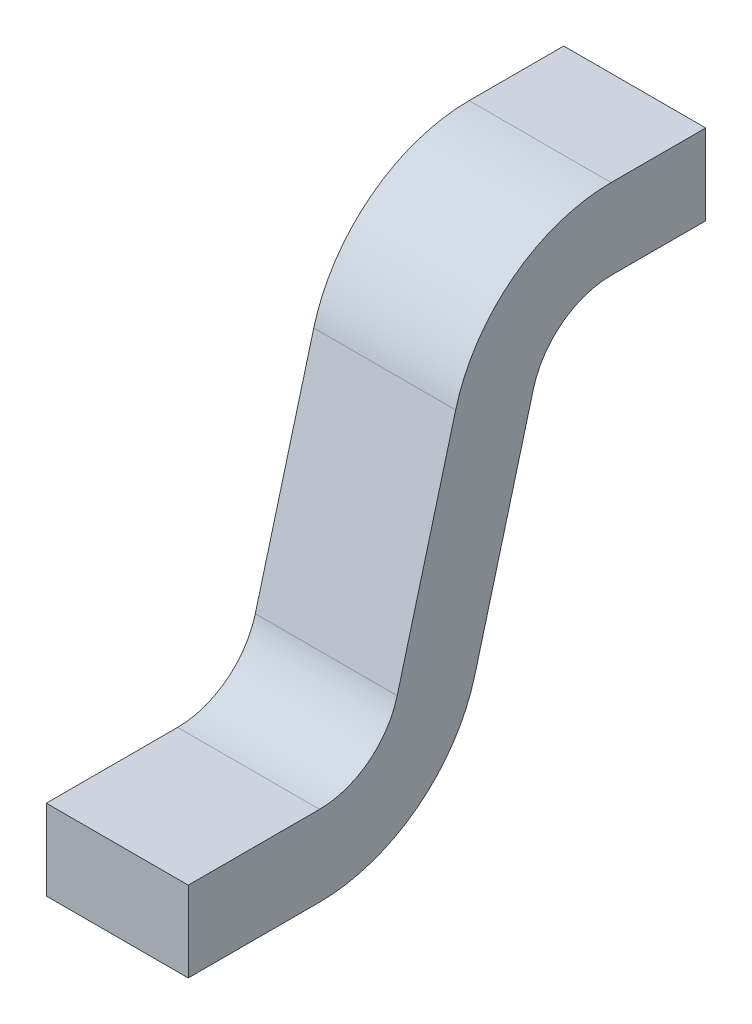
ISO-10303-21;
HEADER;
FILE_DESCRIPTION(('STEP AP214'),'2;1');
FILE_NAME('part.step','',(''),(''),'','','');
FILE_SCHEMA(('AUTOMOTIVE_DESIGN { 1 0 10303 214 1 1 1 1 }'));
ENDSEC;
DATA;
#1=APPLICATION_CONTEXT('core data for automotive mechanical design processes');
#2=APPLICATION_PROTOCOL_DEFINITION('international standard','automotive_design',2000,#1);
#3=PRODUCT_CONTEXT('',#1,'mechanical');
#4=PRODUCT('Part','Part','',(#3));
#5=PRODUCT_RELATED_PRODUCT_CATEGORY('part','',(#4));
#6=PRODUCT_DEFINITION_FORMATION('','',#4);
#7=PRODUCT_DEFINITION_CONTEXT('part definition',#1,'design');
#8=PRODUCT_DEFINITION('design','',#6,#7);
#9=PRODUCT_DEFINITION_SHAPE('','',#8);
#10=(LENGTH_UNIT() NAMED_UNIT(*) SI_UNIT(.MILLI.,.METRE.));
#11=(NAMED_UNIT(*) PLANE_ANGLE_UNIT() SI_UNIT($,.RADIAN.));
#12=(NAMED_UNIT(*) SI_UNIT($,.STERADIAN.) SOLID_ANGLE_UNIT());
#13=UNCERTAINTY_MEASURE_WITH_UNIT(LENGTH_MEASURE(1.E-05),#10,'distance_accuracy_value','');
#14=(GEOMETRIC_REPRESENTATION_CONTEXT(3) GLOBAL_UNCERTAINTY_ASSIGNED_CONTEXT((#13)) GLOBAL_UNIT_ASSIGNED_CONTEXT((#10,
#11,#12)) REPRESENTATION_CONTEXT('',''));
#15=CARTESIAN_POINT('',(0.,0.,0.));
#16=DIRECTION('',(0.,0.,1.));
#17=DIRECTION('',(1.,0.,0.));
#18=AXIS2_PLACEMENT_3D('',#15,#16,#17);
#19=CARTESIAN_POINT('',(-0.15,-0.839203393915477,-0.306328844074898));
#20=DIRECTION('',(-1.,0.,0.));
#21=DIRECTION('',(0.,0.,1.));
#22=AXIS2_PLACEMENT_3D('',#19,#20,#21);
#23=PLANE('',#22);
#24=DIRECTION('',(0.,0.,-1.));
#25=VECTOR('',#24,1.);
#26=CARTESIAN_POINT('',(-0.15,0.,0.7));
#27=LINE('',#26,#25);
#28=CARTESIAN_POINT('',(-0.15,0.,0.2));
#29=VERTEX_POINT('',#28);
#30=CARTESIAN_POINT('',(-0.15,0.,0.));
#31=VERTEX_POINT('',#30);
#32=EDGE_CURVE('E129',#29,#31,#27,.T.);
#33=ORIENTED_EDGE('',*,*,#32,.F.);
#34=CARTESIAN_POINT('',(-0.15,-0.17,0.2));
#35=DIRECTION('',(1.,0.,0.));
#36=DIRECTION('',(0.,0.,-1.));
#37=AXIS2_PLACEMENT_3D('',#34,#35,#36);
#38=CIRCLE('',#37,0.17);
#39=CARTESIAN_POINT('',(-0.15,-0.126000762332572,0.364207390469142));
#40=VERTEX_POINT('',#39);
#41=EDGE_CURVE('E138',#29,#40,#38,.T.);
#42=ORIENTED_EDGE('',*,*,#41,.T.);
#43=DIRECTION('',(0.,0.965925826289068,-0.258819045102521));
#44=VECTOR('',#43,1.);
#45=CARTESIAN_POINT('',(-0.15,-0.39401670399252,0.436022045595592));
#46=LINE('',#45,#44);
#47=CARTESIAN_POINT('',(-0.15,-0.587201869250333,0.487785854616096));
#48=VERTEX_POINT('',#47);
#49=EDGE_CURVE('E135',#48,#40,#46,.T.);
#50=ORIENTED_EDGE('',*,*,#49,.F.);
#51=CARTESIAN_POINT('',(-0.15,-0.499203393915476,0.816200635554379));
#52=DIRECTION('',(-1.,0.,0.));
#53=DIRECTION('',(0.,-1.,0.));
#54=AXIS2_PLACEMENT_3D('',#51,#52,#53);
#55=CIRCLE('',#54,0.34);
#56=CARTESIAN_POINT('',(-0.15,-0.839203393915477,0.816200635554379));
#57=VERTEX_POINT('',#56);
#58=EDGE_CURVE('E170',#57,#48,#55,.F.);
#59=ORIENTED_EDGE('',*,*,#58,.F.);
#60=DIRECTION('',(0.,0.,-1.));
#61=VECTOR('',#60,1.);
#62=CARTESIAN_POINT('',(-0.149999999999999,-0.839203393915477,0.393671155925102));
#63=LINE('',#62,#61);
#64=CARTESIAN_POINT('',(-0.149999999999999,-0.839203393915476,1.0936711559251));
#65=VERTEX_POINT('',#64);
#66=EDGE_CURVE('E140',#65,#57,#63,.T.);
#67=ORIENTED_EDGE('',*,*,#66,.F.);
#68=DIRECTION('',(0.,-1.,0.));
#69=VECTOR('',#68,1.);
#70=CARTESIAN_POINT('',(-0.149999999999999,-0.839203393915476,1.0936711559251));
#71=LINE('',#70,#69);
#72=CARTESIAN_POINT('',(-0.149999999999999,-0.669203393915476,1.0936711559251));
#73=VERTEX_POINT('',#72);
#74=EDGE_CURVE('E146',#73,#65,#71,.T.);
#75=ORIENTED_EDGE('',*,*,#74,.F.);
#76=DIRECTION('',(0.,0.,1.));
#77=VECTOR('',#76,1.);
#78=CARTESIAN_POINT('',(-0.149999999999999,-0.669203393915477,0.393671155925102));
#79=LINE('',#78,#77);
#80=CARTESIAN_POINT('',(-0.149999999999999,-0.669203393915477,0.816200635554379));
#81=VERTEX_POINT('',#80);
#82=EDGE_CURVE('E99',#81,#73,#79,.T.);
#83=ORIENTED_EDGE('',*,*,#82,.F.);
#84=CARTESIAN_POINT('',(-0.149999999999999,-0.499203393915476,0.816200635554379));
#85=DIRECTION('',(-1.,0.,0.));
#86=DIRECTION('',(0.,-1.,0.));
#87=AXIS2_PLACEMENT_3D('',#84,#85,#86);
#88=CIRCLE('',#87,0.17);
#89=CARTESIAN_POINT('',(-0.149999999999999,-0.543202631582905,0.651993245085237));
#90=VERTEX_POINT('',#89);
#91=EDGE_CURVE('E19',#81,#90,#88,.F.);
#92=ORIENTED_EDGE('',*,*,#91,.T.);
#93=DIRECTION('',(0.,-0.965925826289068,0.258819045102521));
#94=VECTOR('',#93,1.);
#95=CARTESIAN_POINT('',(-0.15,-0.350017466325091,0.600229436064733));
#96=LINE('',#95,#94);
#97=CARTESIAN_POINT('',(-0.15,-0.0820015246651429,0.528414780938283));
#98=VERTEX_POINT('',#97);
#99=EDGE_CURVE('E96',#98,#90,#96,.T.);
#100=ORIENTED_EDGE('',*,*,#99,.F.);
#101=CARTESIAN_POINT('',(-0.15,-0.17,0.2));
#102=DIRECTION('',(1.,0.,0.));
#103=DIRECTION('',(0.,0.,-1.));
#104=AXIS2_PLACEMENT_3D('',#101,#102,#103);
#105=CIRCLE('',#104,0.34);
#106=CARTESIAN_POINT('',(-0.15,0.17,0.2));
#107=VERTEX_POINT('',#106);
#108=EDGE_CURVE('E167',#107,#98,#105,.T.);
#109=ORIENTED_EDGE('',*,*,#108,.F.);
#110=DIRECTION('',(0.,0.,1.));
#111=VECTOR('',#110,1.);
#112=CARTESIAN_POINT('',(-0.15,0.17,0.7));
#113=LINE('',#112,#111);
#114=CARTESIAN_POINT('',(-0.15,0.17,0.));
#115=VERTEX_POINT('',#114);
#116=EDGE_CURVE('E118',#115,#107,#113,.T.);
#117=ORIENTED_EDGE('',*,*,#116,.F.);
#118=DIRECTION('',(0.,1.,0.));
#119=VECTOR('',#118,1.);
#120=CARTESIAN_POINT('',(-0.15,0.,0.));
#121=LINE('',#120,#119);
#122=EDGE_CURVE('E123',#31,#115,#121,.T.);
#123=ORIENTED_EDGE('',*,*,#122,.F.);
#124=EDGE_LOOP('',(#33,#42,#50,#59,#67,#75,#83,#92,#100,#109,#117,#123));
#125=FACE_BOUND('',#124,.T.);
#126=ADVANCED_FACE('F16',(#125),#23,.T.);
#127=CARTESIAN_POINT('',(0.,-0.350017466325091,0.600229436064733));
#128=DIRECTION('',(0.,0.258819045102521,0.965925826289068));
#129=DIRECTION('',(0.,-0.965925826289068,0.258819045102521));
#130=AXIS2_PLACEMENT_3D('',#127,#128,#129);
#131=PLANE('',#130);
#132=DIRECTION('',(-1.,0.,0.));
#133=VECTOR('',#132,1.);
#134=CARTESIAN_POINT('',(-0.267707469156736,-0.543202631582905,0.651993245085238));
#135=LINE('',#134,#133);
#136=CARTESIAN_POINT('',(0.15,-0.543202631582905,0.651993245085238));
#137=VERTEX_POINT('',#136);
#138=EDGE_CURVE('E101',#90,#137,#135,.F.);
#139=ORIENTED_EDGE('',*,*,#138,.T.);
#140=DIRECTION('',(0.,-0.965925826289068,0.258819045102522));
#141=VECTOR('',#140,1.);
#142=CARTESIAN_POINT('',(0.15,-0.0820015246651429,0.528414780938283));
#143=LINE('',#142,#141);
#144=CARTESIAN_POINT('',(0.15,-0.0820015246651427,0.528414780938283));
#145=VERTEX_POINT('',#144);
#146=EDGE_CURVE('E166',#145,#137,#143,.T.);
#147=ORIENTED_EDGE('',*,*,#146,.F.);
#148=DIRECTION('',(1.,0.,0.));
#149=VECTOR('',#148,1.);
#150=CARTESIAN_POINT('',(0.194661618624334,-0.0820015246651429,0.528414780938283));
#151=LINE('',#150,#149);
#152=EDGE_CURVE('E106',#98,#145,#151,.T.);
#153=ORIENTED_EDGE('',*,*,#152,.F.);
#154=ORIENTED_EDGE('',*,*,#99,.T.);
#155=EDGE_LOOP('',(#139,#147,#153,#154));
#156=FACE_BOUND('',#155,.T.);
#157=ADVANCED_FACE('F103',(#156),#131,.T.);
#158=CARTESIAN_POINT('',(-0.267707469156736,-0.499203393915476,0.816200635554379));
#159=DIRECTION('',(-1.,0.,0.));
#160=DIRECTION('',(0.,-1.,0.));
#161=AXIS2_PLACEMENT_3D('',#158,#159,#160);
#162=CYLINDRICAL_SURFACE('',#161,0.17);
#163=CARTESIAN_POINT('',(0.15,-0.499203393915476,0.816200635554379));
#164=DIRECTION('',(-1.,0.,0.));
#165=DIRECTION('',(0.,-1.,0.));
#166=AXIS2_PLACEMENT_3D('',#163,#164,#165);
#167=CIRCLE('',#166,0.17);
#168=CARTESIAN_POINT('',(0.15,-0.669203393915476,0.816200635554379));
#169=VERTEX_POINT('',#168);
#170=EDGE_CURVE('E111',#137,#169,#167,.T.);
#171=ORIENTED_EDGE('',*,*,#170,.F.);
#172=ORIENTED_EDGE('',*,*,#138,.F.);
#173=ORIENTED_EDGE('',*,*,#91,.F.);
#174=DIRECTION('',(1.,0.,0.));
#175=VECTOR('',#174,1.);
#176=CARTESIAN_POINT('',(0.,-0.669203393915477,0.816200635554379));
#177=LINE('',#176,#175);
#178=EDGE_CURVE('E113',#169,#81,#177,.F.);
#179=ORIENTED_EDGE('',*,*,#178,.F.);
#180=EDGE_LOOP('',(#171,#172,#173,#179));
#181=FACE_BOUND('',#180,.T.);
#182=ADVANCED_FACE('F109',(#181),#162,.F.);
#183=CARTESIAN_POINT('',(0.,-0.669203393915477,0.393671155925102));
#184=DIRECTION('',(0.,1.,0.));
#185=DIRECTION('',(0.,0.,1.));
#186=AXIS2_PLACEMENT_3D('',#183,#184,#185);
#187=PLANE('',#186);
#188=DIRECTION('',(1.,0.,0.));
#189=VECTOR('',#188,1.);
#190=CARTESIAN_POINT('',(-0.149999999999999,-0.669203393915476,1.0936711559251));
#191=LINE('',#190,#189);
#192=CARTESIAN_POINT('',(0.15,-0.669203393915476,1.0936711559251));
#193=VERTEX_POINT('',#192);
#194=EDGE_CURVE('E149',#193,#73,#191,.F.);
#195=ORIENTED_EDGE('',*,*,#194,.F.);
#196=DIRECTION('',(0.,0.,-1.));
#197=VECTOR('',#196,1.);
#198=CARTESIAN_POINT('',(0.15,-0.669203393915476,1.0936711559251));
#199=LINE('',#198,#197);
#200=EDGE_CURVE('E165',#169,#193,#199,.F.);
#201=ORIENTED_EDGE('',*,*,#200,.F.);
#202=ORIENTED_EDGE('',*,*,#178,.T.);
#203=ORIENTED_EDGE('',*,*,#82,.T.);
#204=EDGE_LOOP('',(#195,#201,#202,#203));
#205=FACE_BOUND('',#204,.T.);
#206=ADVANCED_FACE('F201',(#205),#187,.T.);
#207=CARTESIAN_POINT('',(-0.149999999999999,-0.839203393915476,1.0936711559251));
#208=DIRECTION('',(0.,0.,1.));
#209=DIRECTION('',(0.,-1.,0.));
#210=AXIS2_PLACEMENT_3D('',#207,#208,#209);
#211=PLANE('',#210);
#212=ORIENTED_EDGE('',*,*,#194,.T.);
#213=ORIENTED_EDGE('',*,*,#74,.T.);
#214=DIRECTION('',(1.,0.,0.));
#215=VECTOR('',#214,1.);
#216=CARTESIAN_POINT('',(0.,-0.839203393915477,1.0936711559251));
#217=LINE('',#216,#215);
#218=CARTESIAN_POINT('',(0.15,-0.839203393915476,1.0936711559251));
#219=VERTEX_POINT('',#218);
#220=EDGE_CURVE('E143',#219,#65,#217,.F.);
#221=ORIENTED_EDGE('',*,*,#220,.F.);
#222=DIRECTION('',(0.,1.,0.));
#223=VECTOR('',#222,1.);
#224=CARTESIAN_POINT('',(0.15,-0.839203393915476,1.0936711559251));
#225=LINE('',#224,#223);
#226=EDGE_CURVE('E185',#193,#219,#225,.F.);
#227=ORIENTED_EDGE('',*,*,#226,.F.);
#228=EDGE_LOOP('',(#212,#213,#221,#227));
#229=FACE_BOUND('',#228,.T.);
#230=ADVANCED_FACE('F195',(#229),#211,.T.);
#231=CARTESIAN_POINT('',(0.,-0.839203393915477,0.393671155925102));
#232=DIRECTION('',(0.,-1.,0.));
#233=DIRECTION('',(0.,0.,-1.));
#234=AXIS2_PLACEMENT_3D('',#231,#232,#233);
#235=PLANE('',#234);
#236=ORIENTED_EDGE('',*,*,#220,.T.);
#237=ORIENTED_EDGE('',*,*,#66,.T.);
#238=DIRECTION('',(-1.,0.,0.));
#239=VECTOR('',#238,1.);
#240=CARTESIAN_POINT('',(-0.267707469156736,-0.839203393915476,0.816200635554379));
#241=LINE('',#240,#239);
#242=CARTESIAN_POINT('',(0.15,-0.839203393915476,0.816200635554379));
#243=VERTEX_POINT('',#242);
#244=EDGE_CURVE('E142',#243,#57,#241,.T.);
#245=ORIENTED_EDGE('',*,*,#244,.F.);
#246=DIRECTION('',(0.,0.,-1.));
#247=VECTOR('',#246,1.);
#248=CARTESIAN_POINT('',(0.15,-0.839203393915476,1.0936711559251));
#249=LINE('',#248,#247);
#250=EDGE_CURVE('E163',#219,#243,#249,.T.);
#251=ORIENTED_EDGE('',*,*,#250,.F.);
#252=EDGE_LOOP('',(#236,#237,#245,#251));
#253=FACE_BOUND('',#252,.T.);
#254=ADVANCED_FACE('F266',(#253),#235,.T.);
#255=CARTESIAN_POINT('',(-0.267707469156736,-0.499203393915476,0.816200635554379));
#256=DIRECTION('',(-1.,0.,0.));
#257=DIRECTION('',(0.,-1.,0.));
#258=AXIS2_PLACEMENT_3D('',#255,#256,#257);
#259=CYLINDRICAL_SURFACE('',#258,0.34);
#260=DIRECTION('',(1.,0.,0.));
#261=VECTOR('',#260,1.);
#262=CARTESIAN_POINT('',(0.,-0.587201869250334,0.487785854616096));
#263=LINE('',#262,#261);
#264=CARTESIAN_POINT('',(0.15,-0.587201869250333,0.487785854616096));
#265=VERTEX_POINT('',#264);
#266=EDGE_CURVE('E139',#265,#48,#263,.F.);
#267=ORIENTED_EDGE('',*,*,#266,.F.);
#268=CARTESIAN_POINT('',(0.15,-0.499203393915476,0.816200635554379));
#269=DIRECTION('',(-1.,0.,0.));
#270=DIRECTION('',(0.,-1.,0.));
#271=AXIS2_PLACEMENT_3D('',#268,#269,#270);
#272=CIRCLE('',#271,0.34);
#273=EDGE_CURVE('E160',#243,#265,#272,.F.);
#274=ORIENTED_EDGE('',*,*,#273,.F.);
#275=ORIENTED_EDGE('',*,*,#244,.T.);
#276=ORIENTED_EDGE('',*,*,#58,.T.);
#277=EDGE_LOOP('',(#267,#274,#275,#276));
#278=FACE_BOUND('',#277,.T.);
#279=ADVANCED_FACE('F263',(#278),#259,.T.);
#280=CARTESIAN_POINT('',(0.,-0.39401670399252,0.436022045595592));
#281=DIRECTION('',(0.,-0.258819045102521,-0.965925826289068));
#282=DIRECTION('',(0.,0.965925826289068,-0.258819045102521));
#283=AXIS2_PLACEMENT_3D('',#280,#281,#282);
#284=PLANE('',#283);
#285=ORIENTED_EDGE('',*,*,#266,.T.);
#286=ORIENTED_EDGE('',*,*,#49,.T.);
#287=DIRECTION('',(1.,0.,0.));
#288=VECTOR('',#287,1.);
#289=CARTESIAN_POINT('',(0.194661618624334,-0.126000762332572,0.364207390469142));
#290=LINE('',#289,#288);
#291=CARTESIAN_POINT('',(0.15,-0.126000762332572,0.364207390469142));
#292=VERTEX_POINT('',#291);
#293=EDGE_CURVE('E169',#40,#292,#290,.T.);
#294=ORIENTED_EDGE('',*,*,#293,.T.);
#295=DIRECTION('',(0.,0.965925826289068,-0.25881904510252));
#296=VECTOR('',#295,1.);
#297=CARTESIAN_POINT('',(0.15,-0.587201869250334,0.487785854616096));
#298=LINE('',#297,#296);
#299=EDGE_CURVE('E159',#265,#292,#298,.T.);
#300=ORIENTED_EDGE('',*,*,#299,.F.);
#301=EDGE_LOOP('',(#285,#286,#294,#300));
#302=FACE_BOUND('',#301,.T.);
#303=ADVANCED_FACE('F236',(#302),#284,.T.);
#304=CARTESIAN_POINT('',(0.194661618624334,-0.17,0.2));
#305=DIRECTION('',(1.,0.,0.));
#306=DIRECTION('',(0.,0.,-1.));
#307=AXIS2_PLACEMENT_3D('',#304,#305,#306);
#308=CYLINDRICAL_SURFACE('',#307,0.17);
#309=ORIENTED_EDGE('',*,*,#41,.F.);
#310=DIRECTION('',(1.,0.,0.));
#311=VECTOR('',#310,1.);
#312=CARTESIAN_POINT('',(0.,0.,0.2));
#313=LINE('',#312,#311);
#314=CARTESIAN_POINT('',(0.15,0.,0.2));
#315=VERTEX_POINT('',#314);
#316=EDGE_CURVE('E132',#315,#29,#313,.F.);
#317=ORIENTED_EDGE('',*,*,#316,.F.);
#318=CARTESIAN_POINT('',(0.15,-0.17,0.2));
#319=DIRECTION('',(1.,0.,0.));
#320=DIRECTION('',(0.,0.,-1.));
#321=AXIS2_PLACEMENT_3D('',#318,#319,#320);
#322=CIRCLE('',#321,0.17);
#323=EDGE_CURVE('E155',#292,#315,#322,.F.);
#324=ORIENTED_EDGE('',*,*,#323,.F.);
#325=ORIENTED_EDGE('',*,*,#293,.F.);
#326=EDGE_LOOP('',(#309,#317,#324,#325));
#327=FACE_BOUND('',#326,.T.);
#328=ADVANCED_FACE('F239',(#327),#308,.F.);
#329=CARTESIAN_POINT('',(0.,0.,0.7));
#330=DIRECTION('',(0.,-1.,0.));
#331=DIRECTION('',(0.,0.,-1.));
#332=AXIS2_PLACEMENT_3D('',#329,#330,#331);
#333=PLANE('',#332);
#334=DIRECTION('',(-1.,0.,0.));
#335=VECTOR('',#334,1.);
#336=CARTESIAN_POINT('',(0.15,0.,0.));
#337=LINE('',#336,#335);
#338=CARTESIAN_POINT('',(0.15,0.,0.));
#339=VERTEX_POINT('',#338);
#340=EDGE_CURVE('E126',#339,#31,#337,.T.);
#341=ORIENTED_EDGE('',*,*,#340,.F.);
#342=DIRECTION('',(0.,0.,-1.));
#343=VECTOR('',#342,1.);
#344=CARTESIAN_POINT('',(0.15,0.,1.0936711559251));
#345=LINE('',#344,#343);
#346=EDGE_CURVE('E158',#315,#339,#345,.T.);
#347=ORIENTED_EDGE('',*,*,#346,.F.);
#348=ORIENTED_EDGE('',*,*,#316,.T.);
#349=ORIENTED_EDGE('',*,*,#32,.T.);
#350=EDGE_LOOP('',(#341,#347,#348,#349));
#351=FACE_BOUND('',#350,.T.);
#352=ADVANCED_FACE('F262',(#351),#333,.T.);
#353=CARTESIAN_POINT('',(0.15,0.,0.));
#354=DIRECTION('',(0.,0.,-1.));
#355=DIRECTION('',(-1.,0.,0.));
#356=AXIS2_PLACEMENT_3D('',#353,#354,#355);
#357=PLANE('',#356);
#358=DIRECTION('',(1.,0.,0.));
#359=VECTOR('',#358,1.);
#360=CARTESIAN_POINT('',(0.,0.17,0.));
#361=LINE('',#360,#359);
#362=CARTESIAN_POINT('',(0.15,0.17,0.));
#363=VERTEX_POINT('',#362);
#364=EDGE_CURVE('E120',#363,#115,#361,.F.);
#365=ORIENTED_EDGE('',*,*,#364,.F.);
#366=DIRECTION('',(0.,1.,0.));
#367=VECTOR('',#366,1.);
#368=CARTESIAN_POINT('',(0.15,-0.839203393915476,0.));
#369=LINE('',#368,#367);
#370=EDGE_CURVE('E224',#339,#363,#369,.T.);
#371=ORIENTED_EDGE('',*,*,#370,.F.);
#372=ORIENTED_EDGE('',*,*,#340,.T.);
#373=ORIENTED_EDGE('',*,*,#122,.T.);
#374=EDGE_LOOP('',(#365,#371,#372,#373));
#375=FACE_BOUND('',#374,.T.);
#376=ADVANCED_FACE('F212',(#375),#357,.T.);
#377=CARTESIAN_POINT('',(0.,0.17,0.7));
#378=DIRECTION('',(0.,1.,0.));
#379=DIRECTION('',(0.,0.,1.));
#380=AXIS2_PLACEMENT_3D('',#377,#378,#379);
#381=PLANE('',#380);
#382=ORIENTED_EDGE('',*,*,#364,.T.);
#383=ORIENTED_EDGE('',*,*,#116,.T.);
#384=DIRECTION('',(1.,0.,0.));
#385=VECTOR('',#384,1.);
#386=CARTESIAN_POINT('',(0.194661618624334,0.17,0.2));
#387=LINE('',#386,#385);
#388=CARTESIAN_POINT('',(0.15,0.17,0.2));
#389=VERTEX_POINT('',#388);
#390=EDGE_CURVE('E34',#389,#107,#387,.F.);
#391=ORIENTED_EDGE('',*,*,#390,.F.);
#392=DIRECTION('',(0.,0.,-1.));
#393=VECTOR('',#392,1.);
#394=CARTESIAN_POINT('',(0.15,0.17,1.0936711559251));
#395=LINE('',#394,#393);
#396=EDGE_CURVE('E25',#363,#389,#395,.F.);
#397=ORIENTED_EDGE('',*,*,#396,.F.);
#398=EDGE_LOOP('',(#382,#383,#391,#397));
#399=FACE_BOUND('',#398,.T.);
#400=ADVANCED_FACE('F215',(#399),#381,.T.);
#401=CARTESIAN_POINT('',(0.194661618624334,-0.17,0.2));
#402=DIRECTION('',(1.,0.,0.));
#403=DIRECTION('',(0.,0.,-1.));
#404=AXIS2_PLACEMENT_3D('',#401,#402,#403);
#405=CYLINDRICAL_SURFACE('',#404,0.34);
#406=ORIENTED_EDGE('',*,*,#390,.T.);
#407=ORIENTED_EDGE('',*,*,#108,.T.);
#408=ORIENTED_EDGE('',*,*,#152,.T.);
#409=CARTESIAN_POINT('',(0.15,-0.17,0.2));
#410=DIRECTION('',(1.,0.,0.));
#411=DIRECTION('',(0.,0.,-1.));
#412=AXIS2_PLACEMENT_3D('',#409,#410,#411);
#413=CIRCLE('',#412,0.34);
#414=EDGE_CURVE('E11',#389,#145,#413,.T.);
#415=ORIENTED_EDGE('',*,*,#414,.F.);
#416=EDGE_LOOP('',(#406,#407,#408,#415));
#417=FACE_BOUND('',#416,.T.);
#418=ADVANCED_FACE('F257',(#417),#405,.T.);
#419=CARTESIAN_POINT('',(0.15,-0.839203393915476,1.0936711559251));
#420=DIRECTION('',(1.,0.,0.));
#421=DIRECTION('',(0.,0.,-1.));
#422=AXIS2_PLACEMENT_3D('',#419,#420,#421);
#423=PLANE('',#422);
#424=ORIENTED_EDGE('',*,*,#396,.T.);
#425=ORIENTED_EDGE('',*,*,#414,.T.);
#426=ORIENTED_EDGE('',*,*,#146,.T.);
#427=ORIENTED_EDGE('',*,*,#170,.T.);
#428=ORIENTED_EDGE('',*,*,#200,.T.);
#429=ORIENTED_EDGE('',*,*,#226,.T.);
#430=ORIENTED_EDGE('',*,*,#250,.T.);
#431=ORIENTED_EDGE('',*,*,#273,.T.);
#432=ORIENTED_EDGE('',*,*,#299,.T.);
#433=ORIENTED_EDGE('',*,*,#323,.T.);
#434=ORIENTED_EDGE('',*,*,#346,.T.);
#435=ORIENTED_EDGE('',*,*,#370,.T.);
#436=EDGE_LOOP('',(#424,#425,#426,#427,#428,#429,#430,#431,#432,#433,#434,#435));
#437=FACE_BOUND('',#436,.T.);
#438=ADVANCED_FACE('F243',(#437),#423,.T.);
#439=CLOSED_SHELL('',(#126,#157,#182,#206,#230,#254,#279,#303,#328,#352,#376,#400,#418,#438));
#440=MANIFOLD_SOLID_BREP('B1',#439);
#441=ADVANCED_BREP_SHAPE_REPRESENTATION('',(#18,#440),#14);
#442=SHAPE_DEFINITION_REPRESENTATION(#9,#441);
ENDSEC;
END-ISO-10303-21;
